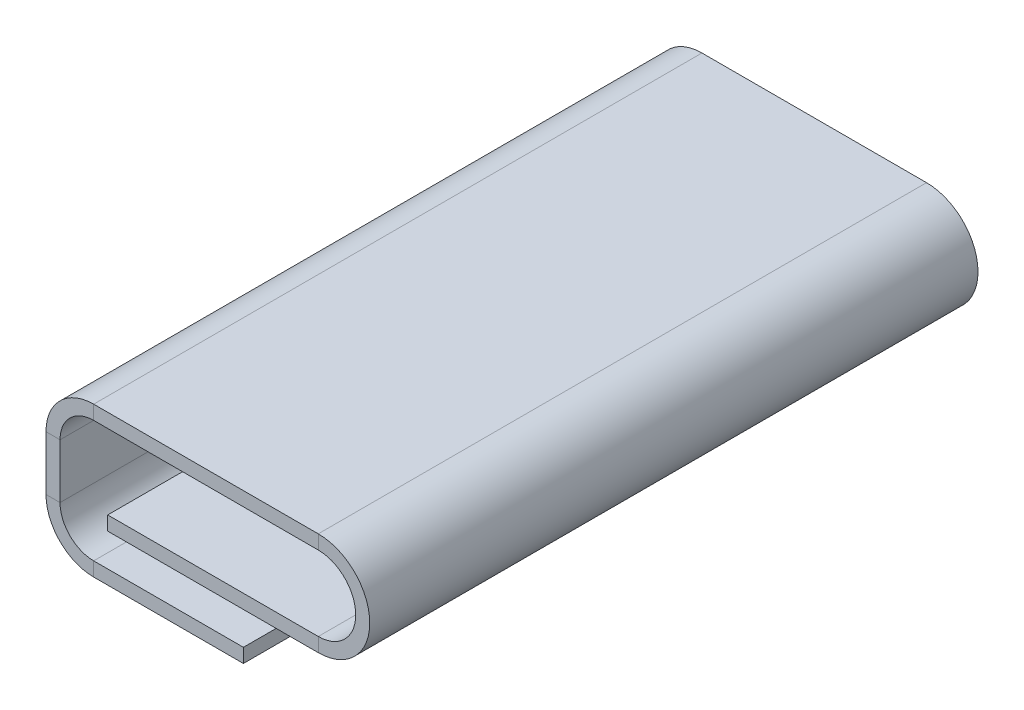
ISO-10303-21;
HEADER;
FILE_DESCRIPTION(('STEP AP214'),'2;1');
FILE_NAME('part.step','',(''),(''),'','','');
FILE_SCHEMA(('AUTOMOTIVE_DESIGN { 1 0 10303 214 1 1 1 1 }'));
ENDSEC;
DATA;
#1=APPLICATION_CONTEXT('core data for automotive mechanical design processes');
#2=APPLICATION_PROTOCOL_DEFINITION('international standard','automotive_design',2000,#1);
#3=PRODUCT_CONTEXT('',#1,'mechanical');
#4=PRODUCT('Part','Part','',(#3));
#5=PRODUCT_RELATED_PRODUCT_CATEGORY('part','',(#4));
#6=PRODUCT_DEFINITION_FORMATION('','',#4);
#7=PRODUCT_DEFINITION_CONTEXT('part definition',#1,'design');
#8=PRODUCT_DEFINITION('design','',#6,#7);
#9=PRODUCT_DEFINITION_SHAPE('','',#8);
#10=(LENGTH_UNIT() NAMED_UNIT(*) SI_UNIT(.MILLI.,.METRE.));
#11=(NAMED_UNIT(*) PLANE_ANGLE_UNIT() SI_UNIT($,.RADIAN.));
#12=(NAMED_UNIT(*) SI_UNIT($,.STERADIAN.) SOLID_ANGLE_UNIT());
#13=UNCERTAINTY_MEASURE_WITH_UNIT(LENGTH_MEASURE(1.E-05),#10,'distance_accuracy_value','');
#14=(GEOMETRIC_REPRESENTATION_CONTEXT(3) GLOBAL_UNCERTAINTY_ASSIGNED_CONTEXT((#13)) GLOBAL_UNIT_ASSIGNED_CONTEXT((#10,
#11,#12)) REPRESENTATION_CONTEXT('',''));
#15=CARTESIAN_POINT('',(0.,0.,0.));
#16=DIRECTION('',(0.,0.,1.));
#17=DIRECTION('',(1.,0.,0.));
#18=AXIS2_PLACEMENT_3D('',#15,#16,#17);
#19=CARTESIAN_POINT('',(3.20000000000001,2.6,6.5));
#20=DIRECTION('',(0.,0.,1.));
#21=DIRECTION('',(1.,0.,0.));
#22=AXIS2_PLACEMENT_3D('',#19,#20,#21);
#23=PLANE('',#22);
#24=DIRECTION('',(0.,1.,0.));
#25=VECTOR('',#24,1.);
#26=CARTESIAN_POINT('',(3.20000000000001,2.6,6.5));
#27=LINE('',#26,#25);
#28=CARTESIAN_POINT('',(3.20000000000001,2.6,6.5));
#29=VERTEX_POINT('',#28);
#30=CARTESIAN_POINT('',(3.20000000000001,2.9,6.5));
#31=VERTEX_POINT('',#30);
#32=EDGE_CURVE('E11',#29,#31,#27,.T.);
#33=ORIENTED_EDGE('',*,*,#32,.F.);
#34=CARTESIAN_POINT('',(3.2,1.8,6.5));
#35=DIRECTION('',(0.,0.,1.));
#36=DIRECTION('',(-1.,0.,0.));
#37=AXIS2_PLACEMENT_3D('',#34,#35,#36);
#38=CIRCLE('',#37,0.8);
#39=CARTESIAN_POINT('',(3.20000000000001,1.,6.5));
#40=VERTEX_POINT('',#39);
#41=EDGE_CURVE('E316',#40,#29,#38,.T.);
#42=ORIENTED_EDGE('',*,*,#41,.F.);
#43=DIRECTION('',(0.,1.,0.));
#44=VECTOR('',#43,1.);
#45=CARTESIAN_POINT('',(3.20000000000001,0.7,6.5));
#46=LINE('',#45,#44);
#47=CARTESIAN_POINT('',(3.20000000000001,0.7,6.5));
#48=VERTEX_POINT('',#47);
#49=EDGE_CURVE('E51',#48,#40,#46,.T.);
#50=ORIENTED_EDGE('',*,*,#49,.F.);
#51=CARTESIAN_POINT('',(3.2,1.8,6.5));
#52=DIRECTION('',(0.,0.,1.));
#53=DIRECTION('',(1.,0.,0.));
#54=AXIS2_PLACEMENT_3D('',#51,#52,#53);
#55=CIRCLE('',#54,1.1);
#56=EDGE_CURVE('E330',#48,#31,#55,.T.);
#57=ORIENTED_EDGE('',*,*,#56,.T.);
#58=EDGE_LOOP('',(#33,#42,#50,#57));
#59=FACE_BOUND('',#58,.T.);
#60=ADVANCED_FACE('F43',(#59),#23,.T.);
#61=CARTESIAN_POINT('',(3.20000000000001,0.7,6.5));
#62=DIRECTION('',(0.,0.,1.));
#63=DIRECTION('',(1.,0.,0.));
#64=AXIS2_PLACEMENT_3D('',#61,#62,#63);
#65=PLANE('',#64);
#66=DIRECTION('',(-1.,0.,0.));
#67=VECTOR('',#66,1.);
#68=CARTESIAN_POINT('',(3.20000000000001,2.6,6.5));
#69=LINE('',#68,#67);
#70=CARTESIAN_POINT('',(-1.59999999999999,2.6,6.5));
#71=VERTEX_POINT('',#70);
#72=EDGE_CURVE('E320',#29,#71,#69,.T.);
#73=ORIENTED_EDGE('',*,*,#72,.F.);
#74=ORIENTED_EDGE('',*,*,#32,.T.);
#75=DIRECTION('',(-1.,0.,0.));
#76=VECTOR('',#75,1.);
#77=CARTESIAN_POINT('',(3.20000000000001,2.9,6.5));
#78=LINE('',#77,#76);
#79=CARTESIAN_POINT('',(-1.59999999999999,2.9,6.5));
#80=VERTEX_POINT('',#79);
#81=EDGE_CURVE('E186',#31,#80,#78,.T.);
#82=ORIENTED_EDGE('',*,*,#81,.T.);
#83=DIRECTION('',(0.,-1.,0.));
#84=VECTOR('',#83,1.);
#85=CARTESIAN_POINT('',(-1.59999999999999,2.9,6.5));
#86=LINE('',#85,#84);
#87=EDGE_CURVE('E177',#80,#71,#86,.T.);
#88=ORIENTED_EDGE('',*,*,#87,.T.);
#89=EDGE_LOOP('',(#73,#74,#82,#88));
#90=FACE_BOUND('',#89,.T.);
#91=ADVANCED_FACE('F335',(#90),#65,.T.);
#92=CARTESIAN_POINT('',(3.20000000000001,1.,-6.5));
#93=DIRECTION('',(0.,0.,-1.));
#94=DIRECTION('',(-1.,0.,0.));
#95=AXIS2_PLACEMENT_3D('',#92,#93,#94);
#96=PLANE('',#95);
#97=DIRECTION('',(0.,-1.,0.));
#98=VECTOR('',#97,1.);
#99=CARTESIAN_POINT('',(3.20000000000001,1.,-6.5));
#100=LINE('',#99,#98);
#101=CARTESIAN_POINT('',(3.20000000000001,1.,-6.5));
#102=VERTEX_POINT('',#101);
#103=CARTESIAN_POINT('',(3.20000000000001,0.7,-6.5));
#104=VERTEX_POINT('',#103);
#105=EDGE_CURVE('E297',#102,#104,#100,.T.);
#106=ORIENTED_EDGE('',*,*,#105,.F.);
#107=CARTESIAN_POINT('',(3.2,1.8,-6.5));
#108=DIRECTION('',(0.,0.,1.));
#109=DIRECTION('',(-1.,0.,0.));
#110=AXIS2_PLACEMENT_3D('',#107,#108,#109);
#111=CIRCLE('',#110,0.8);
#112=CARTESIAN_POINT('',(3.20000000000001,2.6,-6.5));
#113=VERTEX_POINT('',#112);
#114=EDGE_CURVE('E226',#102,#113,#111,.T.);
#115=ORIENTED_EDGE('',*,*,#114,.T.);
#116=DIRECTION('',(0.,-1.,0.));
#117=VECTOR('',#116,1.);
#118=CARTESIAN_POINT('',(3.20000000000001,2.9,-6.5));
#119=LINE('',#118,#117);
#120=CARTESIAN_POINT('',(3.20000000000001,2.9,-6.5));
#121=VERTEX_POINT('',#120);
#122=EDGE_CURVE('E176',#121,#113,#119,.T.);
#123=ORIENTED_EDGE('',*,*,#122,.F.);
#124=CARTESIAN_POINT('',(3.2,1.8,-6.5));
#125=DIRECTION('',(0.,0.,1.));
#126=DIRECTION('',(1.,0.,0.));
#127=AXIS2_PLACEMENT_3D('',#124,#125,#126);
#128=CIRCLE('',#127,1.1);
#129=EDGE_CURVE('E238',#104,#121,#128,.T.);
#130=ORIENTED_EDGE('',*,*,#129,.F.);
#131=EDGE_LOOP('',(#106,#115,#123,#130));
#132=FACE_BOUND('',#131,.T.);
#133=ADVANCED_FACE('F387',(#132),#96,.T.);
#134=CARTESIAN_POINT('',(3.20000000000001,2.9,-6.5));
#135=DIRECTION('',(0.,0.,-1.));
#136=DIRECTION('',(-1.,0.,0.));
#137=AXIS2_PLACEMENT_3D('',#134,#135,#136);
#138=PLANE('',#137);
#139=DIRECTION('',(1.,0.,0.));
#140=VECTOR('',#139,1.);
#141=CARTESIAN_POINT('',(-1.3,1.,-6.5));
#142=LINE('',#141,#140);
#143=CARTESIAN_POINT('',(-1.3,1.,-6.5));
#144=VERTEX_POINT('',#143);
#145=EDGE_CURVE('E229',#144,#102,#142,.T.);
#146=ORIENTED_EDGE('',*,*,#145,.T.);
#147=ORIENTED_EDGE('',*,*,#105,.T.);
#148=DIRECTION('',(1.,0.,0.));
#149=VECTOR('',#148,1.);
#150=CARTESIAN_POINT('',(1.6,0.7,-6.5));
#151=LINE('',#150,#149);
#152=CARTESIAN_POINT('',(-1.3,0.7,-6.5));
#153=VERTEX_POINT('',#152);
#154=EDGE_CURVE('E235',#153,#104,#151,.T.);
#155=ORIENTED_EDGE('',*,*,#154,.F.);
#156=DIRECTION('',(0.,1.,0.));
#157=VECTOR('',#156,1.);
#158=CARTESIAN_POINT('',(-1.3,0.7,-6.5));
#159=LINE('',#158,#157);
#160=EDGE_CURVE('E232',#153,#144,#159,.T.);
#161=ORIENTED_EDGE('',*,*,#160,.T.);
#162=EDGE_LOOP('',(#146,#147,#155,#161));
#163=FACE_BOUND('',#162,.T.);
#164=ADVANCED_FACE('F390',(#163),#138,.T.);
#165=CARTESIAN_POINT('',(-2.31891077438566,1.88108922561433,6.5));
#166=DIRECTION('',(0.,0.,1.));
#167=DIRECTION('',(1.,0.,0.));
#168=AXIS2_PLACEMENT_3D('',#165,#166,#167);
#169=PLANE('',#168);
#170=DIRECTION('',(-1.,0.,0.));
#171=VECTOR('',#170,1.);
#172=CARTESIAN_POINT('',(-2.31891077438566,1.88108922561433,6.5));
#173=LINE('',#172,#171);
#174=CARTESIAN_POINT('',(-2.31891077438566,1.88108922561433,6.5));
#175=VERTEX_POINT('',#174);
#176=CARTESIAN_POINT('',(-2.61891077438566,1.88108922561433,6.5));
#177=VERTEX_POINT('',#176);
#178=EDGE_CURVE('E164',#175,#177,#173,.T.);
#179=ORIENTED_EDGE('',*,*,#178,.F.);
#180=CARTESIAN_POINT('',(-1.59999999999999,1.88108922561433,6.5));
#181=DIRECTION('',(0.,0.,1.));
#182=DIRECTION('',(1.,0.,0.));
#183=AXIS2_PLACEMENT_3D('',#180,#181,#182);
#184=CIRCLE('',#183,0.718910774385668);
#185=EDGE_CURVE('E347',#71,#175,#184,.T.);
#186=ORIENTED_EDGE('',*,*,#185,.F.);
#187=ORIENTED_EDGE('',*,*,#87,.F.);
#188=CARTESIAN_POINT('',(-1.59999999999999,1.88108922561433,6.5));
#189=DIRECTION('',(0.,0.,1.));
#190=DIRECTION('',(1.,0.,0.));
#191=AXIS2_PLACEMENT_3D('',#188,#189,#190);
#192=CIRCLE('',#191,1.01891077438567);
#193=EDGE_CURVE('E180',#80,#177,#192,.T.);
#194=ORIENTED_EDGE('',*,*,#193,.T.);
#195=EDGE_LOOP('',(#179,#186,#187,#194));
#196=FACE_BOUND('',#195,.T.);
#197=ADVANCED_FACE('F182',(#196),#169,.T.);
#198=CARTESIAN_POINT('',(-1.59999999999999,2.9,6.5));
#199=DIRECTION('',(0.,0.,1.));
#200=DIRECTION('',(1.,0.,0.));
#201=AXIS2_PLACEMENT_3D('',#198,#199,#200);
#202=PLANE('',#201);
#203=DIRECTION('',(0.,-1.,0.));
#204=VECTOR('',#203,1.);
#205=CARTESIAN_POINT('',(-2.31891077438566,1.88108922561433,6.5));
#206=LINE('',#205,#204);
#207=CARTESIAN_POINT('',(-2.31891077438566,0.718910774385668,6.5));
#208=VERTEX_POINT('',#207);
#209=EDGE_CURVE('E171',#175,#208,#206,.T.);
#210=ORIENTED_EDGE('',*,*,#209,.F.);
#211=ORIENTED_EDGE('',*,*,#178,.T.);
#212=DIRECTION('',(0.,-1.,0.));
#213=VECTOR('',#212,1.);
#214=CARTESIAN_POINT('',(-2.61891077438566,1.88108922561433,6.5));
#215=LINE('',#214,#213);
#216=CARTESIAN_POINT('',(-2.61891077438566,0.718910774385669,6.5));
#217=VERTEX_POINT('',#216);
#218=EDGE_CURVE('E168',#177,#217,#215,.T.);
#219=ORIENTED_EDGE('',*,*,#218,.T.);
#220=DIRECTION('',(1.,0.,0.));
#221=VECTOR('',#220,1.);
#222=CARTESIAN_POINT('',(-2.61891077438566,0.718910774385669,6.5));
#223=LINE('',#222,#221);
#224=EDGE_CURVE('E288',#217,#208,#223,.T.);
#225=ORIENTED_EDGE('',*,*,#224,.T.);
#226=EDGE_LOOP('',(#210,#211,#219,#225));
#227=FACE_BOUND('',#226,.T.);
#228=ADVANCED_FACE('F166',(#227),#202,.T.);
#229=CARTESIAN_POINT('',(-1.59999999999999,2.6,-6.5));
#230=DIRECTION('',(0.,0.,-1.));
#231=DIRECTION('',(-1.,0.,0.));
#232=AXIS2_PLACEMENT_3D('',#229,#230,#231);
#233=PLANE('',#232);
#234=DIRECTION('',(0.,1.,0.));
#235=VECTOR('',#234,1.);
#236=CARTESIAN_POINT('',(-1.59999999999999,2.6,-6.5));
#237=LINE('',#236,#235);
#238=CARTESIAN_POINT('',(-1.59999999999999,2.6,-6.5));
#239=VERTEX_POINT('',#238);
#240=CARTESIAN_POINT('',(-1.59999999999999,2.9,-6.5));
#241=VERTEX_POINT('',#240);
#242=EDGE_CURVE('E293',#239,#241,#237,.T.);
#243=ORIENTED_EDGE('',*,*,#242,.F.);
#244=CARTESIAN_POINT('',(-1.59999999999999,1.88108922561433,-6.5));
#245=DIRECTION('',(0.,0.,1.));
#246=DIRECTION('',(1.,0.,0.));
#247=AXIS2_PLACEMENT_3D('',#244,#245,#246);
#248=CIRCLE('',#247,0.718910774385668);
#249=CARTESIAN_POINT('',(-2.31891077438566,1.88108922561433,-6.5));
#250=VERTEX_POINT('',#249);
#251=EDGE_CURVE('E220',#239,#250,#248,.T.);
#252=ORIENTED_EDGE('',*,*,#251,.T.);
#253=DIRECTION('',(1.,0.,0.));
#254=VECTOR('',#253,1.);
#255=CARTESIAN_POINT('',(-2.61891077438566,1.88108922561433,-6.5));
#256=LINE('',#255,#254);
#257=CARTESIAN_POINT('',(-2.61891077438566,1.88108922561433,-6.5));
#258=VERTEX_POINT('',#257);
#259=EDGE_CURVE('E291',#258,#250,#256,.T.);
#260=ORIENTED_EDGE('',*,*,#259,.F.);
#261=CARTESIAN_POINT('',(-1.59999999999999,1.88108922561433,-6.5));
#262=DIRECTION('',(0.,0.,1.));
#263=DIRECTION('',(1.,0.,0.));
#264=AXIS2_PLACEMENT_3D('',#261,#262,#263);
#265=CIRCLE('',#264,1.01891077438567);
#266=EDGE_CURVE('E193',#241,#258,#265,.T.);
#267=ORIENTED_EDGE('',*,*,#266,.F.);
#268=EDGE_LOOP('',(#243,#252,#260,#267));
#269=FACE_BOUND('',#268,.T.);
#270=ADVANCED_FACE('F341',(#269),#233,.T.);
#271=CARTESIAN_POINT('',(-2.61891077438566,1.88108922561433,-6.5));
#272=DIRECTION('',(0.,0.,-1.));
#273=DIRECTION('',(-1.,0.,0.));
#274=AXIS2_PLACEMENT_3D('',#271,#272,#273);
#275=PLANE('',#274);
#276=DIRECTION('',(-1.,0.,0.));
#277=VECTOR('',#276,1.);
#278=CARTESIAN_POINT('',(3.20000000000001,2.6,-6.5));
#279=LINE('',#278,#277);
#280=EDGE_CURVE('E223',#113,#239,#279,.T.);
#281=ORIENTED_EDGE('',*,*,#280,.T.);
#282=ORIENTED_EDGE('',*,*,#242,.T.);
#283=DIRECTION('',(-1.,0.,0.));
#284=VECTOR('',#283,1.);
#285=CARTESIAN_POINT('',(3.20000000000001,2.9,-6.5));
#286=LINE('',#285,#284);
#287=EDGE_CURVE('E241',#121,#241,#286,.T.);
#288=ORIENTED_EDGE('',*,*,#287,.F.);
#289=ORIENTED_EDGE('',*,*,#122,.T.);
#290=EDGE_LOOP('',(#281,#282,#288,#289));
#291=FACE_BOUND('',#290,.T.);
#292=ADVANCED_FACE('F400',(#291),#275,.T.);
#293=CARTESIAN_POINT('',(-1.6,0.,6.5));
#294=DIRECTION('',(0.,0.,1.));
#295=DIRECTION('',(1.,0.,0.));
#296=AXIS2_PLACEMENT_3D('',#293,#294,#295);
#297=PLANE('',#296);
#298=DIRECTION('',(0.,-1.,0.));
#299=VECTOR('',#298,1.);
#300=CARTESIAN_POINT('',(-1.6,0.,6.5));
#301=LINE('',#300,#299);
#302=CARTESIAN_POINT('',(-1.6,0.,6.5));
#303=VERTEX_POINT('',#302);
#304=CARTESIAN_POINT('',(-1.6,-0.3,6.5));
#305=VERTEX_POINT('',#304);
#306=EDGE_CURVE('E59',#303,#305,#301,.T.);
#307=ORIENTED_EDGE('',*,*,#306,.F.);
#308=CARTESIAN_POINT('',(-1.59999999999999,0.718910774385668,6.5));
#309=DIRECTION('',(0.,0.,1.));
#310=DIRECTION('',(-1.,0.,0.));
#311=AXIS2_PLACEMENT_3D('',#308,#309,#310);
#312=CIRCLE('',#311,0.718910774385669);
#313=EDGE_CURVE('E375',#208,#303,#312,.T.);
#314=ORIENTED_EDGE('',*,*,#313,.F.);
#315=ORIENTED_EDGE('',*,*,#224,.F.);
#316=CARTESIAN_POINT('',(-1.59999999999999,0.718910774385668,6.5));
#317=DIRECTION('',(0.,0.,1.));
#318=DIRECTION('',(1.,0.,0.));
#319=AXIS2_PLACEMENT_3D('',#316,#317,#318);
#320=CIRCLE('',#319,1.01891077438567);
#321=EDGE_CURVE('E201',#217,#305,#320,.T.);
#322=ORIENTED_EDGE('',*,*,#321,.T.);
#323=EDGE_LOOP('',(#307,#314,#315,#322));
#324=FACE_BOUND('',#323,.T.);
#325=ADVANCED_FACE('F402',(#324),#297,.T.);
#326=CARTESIAN_POINT('',(-2.61891077438566,0.718910774385669,6.5));
#327=DIRECTION('',(0.,0.,1.));
#328=DIRECTION('',(1.,0.,0.));
#329=AXIS2_PLACEMENT_3D('',#326,#327,#328);
#330=PLANE('',#329);
#331=DIRECTION('',(1.,0.,0.));
#332=VECTOR('',#331,1.);
#333=CARTESIAN_POINT('',(-1.6,0.,6.5));
#334=LINE('',#333,#332);
#335=CARTESIAN_POINT('',(1.6,0.,6.5));
#336=VERTEX_POINT('',#335);
#337=EDGE_CURVE('E373',#303,#336,#334,.T.);
#338=ORIENTED_EDGE('',*,*,#337,.F.);
#339=ORIENTED_EDGE('',*,*,#306,.T.);
#340=DIRECTION('',(1.,0.,0.));
#341=VECTOR('',#340,1.);
#342=CARTESIAN_POINT('',(-1.6,-0.3,6.5));
#343=LINE('',#342,#341);
#344=CARTESIAN_POINT('',(1.6,-0.3,6.5));
#345=VERTEX_POINT('',#344);
#346=EDGE_CURVE('E125',#305,#345,#343,.T.);
#347=ORIENTED_EDGE('',*,*,#346,.T.);
#348=DIRECTION('',(0.,-1.,0.));
#349=VECTOR('',#348,1.);
#350=CARTESIAN_POINT('',(1.6,0.,6.5));
#351=LINE('',#350,#349);
#352=EDGE_CURVE('E371',#336,#345,#351,.T.);
#353=ORIENTED_EDGE('',*,*,#352,.F.);
#354=EDGE_LOOP('',(#338,#339,#347,#353));
#355=FACE_BOUND('',#354,.T.);
#356=ADVANCED_FACE('F408',(#355),#330,.T.);
#357=CARTESIAN_POINT('',(-2.31891077438566,0.718910774385668,-6.5));
#358=DIRECTION('',(0.,0.,-1.));
#359=DIRECTION('',(-1.,0.,0.));
#360=AXIS2_PLACEMENT_3D('',#357,#358,#359);
#361=PLANE('',#360);
#362=DIRECTION('',(-1.,0.,0.));
#363=VECTOR('',#362,1.);
#364=CARTESIAN_POINT('',(-2.31891077438566,0.718910774385668,-6.5));
#365=LINE('',#364,#363);
#366=CARTESIAN_POINT('',(-2.31891077438566,0.718910774385668,-6.5));
#367=VERTEX_POINT('',#366);
#368=CARTESIAN_POINT('',(-2.61891077438566,0.718910774385669,-6.5));
#369=VERTEX_POINT('',#368);
#370=EDGE_CURVE('E112',#367,#369,#365,.T.);
#371=ORIENTED_EDGE('',*,*,#370,.F.);
#372=CARTESIAN_POINT('',(-1.59999999999999,0.718910774385668,-6.5));
#373=DIRECTION('',(0.,0.,1.));
#374=DIRECTION('',(-1.,0.,0.));
#375=AXIS2_PLACEMENT_3D('',#372,#373,#374);
#376=CIRCLE('',#375,0.718910774385669);
#377=CARTESIAN_POINT('',(-1.6,0.,-6.5));
#378=VERTEX_POINT('',#377);
#379=EDGE_CURVE('E216',#367,#378,#376,.T.);
#380=ORIENTED_EDGE('',*,*,#379,.T.);
#381=DIRECTION('',(0.,1.,0.));
#382=VECTOR('',#381,1.);
#383=CARTESIAN_POINT('',(-1.6,-0.3,-6.5));
#384=LINE('',#383,#382);
#385=CARTESIAN_POINT('',(-1.6,-0.3,-6.5));
#386=VERTEX_POINT('',#385);
#387=EDGE_CURVE('E119',#386,#378,#384,.T.);
#388=ORIENTED_EDGE('',*,*,#387,.F.);
#389=CARTESIAN_POINT('',(-1.59999999999999,0.718910774385668,-6.5));
#390=DIRECTION('',(0.,0.,1.));
#391=DIRECTION('',(1.,0.,0.));
#392=AXIS2_PLACEMENT_3D('',#389,#390,#391);
#393=CIRCLE('',#392,1.01891077438567);
#394=EDGE_CURVE('E247',#369,#386,#393,.T.);
#395=ORIENTED_EDGE('',*,*,#394,.F.);
#396=EDGE_LOOP('',(#371,#380,#388,#395));
#397=FACE_BOUND('',#396,.T.);
#398=ADVANCED_FACE('F358',(#397),#361,.T.);
#399=CARTESIAN_POINT('',(-1.6,-0.3,-6.5));
#400=DIRECTION('',(0.,0.,-1.));
#401=DIRECTION('',(-1.,0.,0.));
#402=AXIS2_PLACEMENT_3D('',#399,#400,#401);
#403=PLANE('',#402);
#404=DIRECTION('',(0.,-1.,0.));
#405=VECTOR('',#404,1.);
#406=CARTESIAN_POINT('',(-2.31891077438566,1.88108922561433,-6.5));
#407=LINE('',#406,#405);
#408=EDGE_CURVE('E218',#250,#367,#407,.T.);
#409=ORIENTED_EDGE('',*,*,#408,.T.);
#410=ORIENTED_EDGE('',*,*,#370,.T.);
#411=DIRECTION('',(0.,-1.,0.));
#412=VECTOR('',#411,1.);
#413=CARTESIAN_POINT('',(-2.61891077438566,1.88108922561433,-6.5));
#414=LINE('',#413,#412);
#415=EDGE_CURVE('E245',#258,#369,#414,.T.);
#416=ORIENTED_EDGE('',*,*,#415,.F.);
#417=ORIENTED_EDGE('',*,*,#259,.T.);
#418=EDGE_LOOP('',(#409,#410,#416,#417));
#419=FACE_BOUND('',#418,.T.);
#420=ADVANCED_FACE('F343',(#419),#403,.T.);
#421=CARTESIAN_POINT('',(-1.6,-0.3,6.5));
#422=DIRECTION('',(0.,1.,0.));
#423=DIRECTION('',(0.,0.,1.));
#424=AXIS2_PLACEMENT_3D('',#421,#422,#423);
#425=PLANE('',#424);
#426=DIRECTION('',(1.,0.,0.));
#427=VECTOR('',#426,1.);
#428=CARTESIAN_POINT('',(-1.6,-0.3,-6.5));
#429=LINE('',#428,#427);
#430=CARTESIAN_POINT('',(1.6,-0.3,-6.5));
#431=VERTEX_POINT('',#430);
#432=EDGE_CURVE('E207',#386,#431,#429,.T.);
#433=ORIENTED_EDGE('',*,*,#432,.T.);
#434=DIRECTION('',(0.,0.,-1.));
#435=VECTOR('',#434,1.);
#436=CARTESIAN_POINT('',(1.6,-0.3,6.5));
#437=LINE('',#436,#435);
#438=EDGE_CURVE('E284',#345,#431,#437,.T.);
#439=ORIENTED_EDGE('',*,*,#438,.F.);
#440=ORIENTED_EDGE('',*,*,#346,.F.);
#441=DIRECTION('',(0.,0.,-1.));
#442=VECTOR('',#441,1.);
#443=CARTESIAN_POINT('',(-1.6,-0.3,6.5));
#444=LINE('',#443,#442);
#445=EDGE_CURVE('E203',#305,#386,#444,.T.);
#446=ORIENTED_EDGE('',*,*,#445,.T.);
#447=EDGE_LOOP('',(#433,#439,#440,#446));
#448=FACE_BOUND('',#447,.T.);
#449=ADVANCED_FACE('F364',(#448),#425,.F.);
#450=CARTESIAN_POINT('',(1.6,0.,6.5));
#451=DIRECTION('',(1.,0.,0.));
#452=DIRECTION('',(0.,0.,-1.));
#453=AXIS2_PLACEMENT_3D('',#450,#451,#452);
#454=PLANE('',#453);
#455=DIRECTION('',(0.,-1.,0.));
#456=VECTOR('',#455,1.);
#457=CARTESIAN_POINT('',(1.6,0.,-6.5));
#458=LINE('',#457,#456);
#459=CARTESIAN_POINT('',(1.6,0.,-6.5));
#460=VERTEX_POINT('',#459);
#461=EDGE_CURVE('E210',#460,#431,#458,.T.);
#462=ORIENTED_EDGE('',*,*,#461,.F.);
#463=DIRECTION('',(0.,0.,-1.));
#464=VECTOR('',#463,1.);
#465=CARTESIAN_POINT('',(1.6,0.,6.5));
#466=LINE('',#465,#464);
#467=EDGE_CURVE('E282',#336,#460,#466,.T.);
#468=ORIENTED_EDGE('',*,*,#467,.F.);
#469=ORIENTED_EDGE('',*,*,#352,.T.);
#470=ORIENTED_EDGE('',*,*,#438,.T.);
#471=EDGE_LOOP('',(#462,#468,#469,#470));
#472=FACE_BOUND('',#471,.T.);
#473=ADVANCED_FACE('F369',(#472),#454,.T.);
#474=CARTESIAN_POINT('',(-1.6,0.,6.5));
#475=DIRECTION('',(0.,1.,0.));
#476=DIRECTION('',(0.,0.,1.));
#477=AXIS2_PLACEMENT_3D('',#474,#475,#476);
#478=PLANE('',#477);
#479=DIRECTION('',(1.,0.,0.));
#480=VECTOR('',#479,1.);
#481=CARTESIAN_POINT('',(-1.6,0.,-6.5));
#482=LINE('',#481,#480);
#483=EDGE_CURVE('E213',#378,#460,#482,.T.);
#484=ORIENTED_EDGE('',*,*,#483,.F.);
#485=DIRECTION('',(0.,0.,-1.));
#486=VECTOR('',#485,1.);
#487=CARTESIAN_POINT('',(-1.6,0.,6.5));
#488=LINE('',#487,#486);
#489=EDGE_CURVE('E279',#303,#378,#488,.T.);
#490=ORIENTED_EDGE('',*,*,#489,.F.);
#491=ORIENTED_EDGE('',*,*,#337,.T.);
#492=ORIENTED_EDGE('',*,*,#467,.T.);
#493=EDGE_LOOP('',(#484,#490,#491,#492));
#494=FACE_BOUND('',#493,.T.);
#495=ADVANCED_FACE('F492',(#494),#478,.T.);
#496=CARTESIAN_POINT('',(-1.59999999999999,0.718910774385668,6.5));
#497=DIRECTION('',(0.,0.,-1.));
#498=DIRECTION('',(-1.,0.,0.));
#499=AXIS2_PLACEMENT_3D('',#496,#497,#498);
#500=CYLINDRICAL_SURFACE('',#499,0.718910774385669);
#501=ORIENTED_EDGE('',*,*,#379,.F.);
#502=DIRECTION('',(0.,0.,-1.));
#503=VECTOR('',#502,1.);
#504=CARTESIAN_POINT('',(-2.31891077438566,0.718910774385668,6.5));
#505=LINE('',#504,#503);
#506=EDGE_CURVE('E276',#208,#367,#505,.T.);
#507=ORIENTED_EDGE('',*,*,#506,.F.);
#508=ORIENTED_EDGE('',*,*,#313,.T.);
#509=ORIENTED_EDGE('',*,*,#489,.T.);
#510=EDGE_LOOP('',(#501,#507,#508,#509));
#511=FACE_BOUND('',#510,.T.);
#512=ADVANCED_FACE('F355',(#511),#500,.F.);
#513=CARTESIAN_POINT('',(-2.31891077438566,1.88108922561433,6.5));
#514=DIRECTION('',(1.,0.,0.));
#515=DIRECTION('',(0.,1.,0.));
#516=AXIS2_PLACEMENT_3D('',#513,#514,#515);
#517=PLANE('',#516);
#518=ORIENTED_EDGE('',*,*,#408,.F.);
#519=DIRECTION('',(0.,0.,-1.));
#520=VECTOR('',#519,1.);
#521=CARTESIAN_POINT('',(-2.31891077438566,1.88108922561433,6.5));
#522=LINE('',#521,#520);
#523=EDGE_CURVE('E273',#175,#250,#522,.T.);
#524=ORIENTED_EDGE('',*,*,#523,.F.);
#525=ORIENTED_EDGE('',*,*,#209,.T.);
#526=ORIENTED_EDGE('',*,*,#506,.T.);
#527=EDGE_LOOP('',(#518,#524,#525,#526));
#528=FACE_BOUND('',#527,.T.);
#529=ADVANCED_FACE('F349',(#528),#517,.T.);
#530=CARTESIAN_POINT('',(-1.59999999999999,1.88108922561433,6.5));
#531=DIRECTION('',(0.,0.,-1.));
#532=DIRECTION('',(-1.,0.,0.));
#533=AXIS2_PLACEMENT_3D('',#530,#531,#532);
#534=CYLINDRICAL_SURFACE('',#533,0.718910774385668);
#535=ORIENTED_EDGE('',*,*,#251,.F.);
#536=DIRECTION('',(0.,0.,-1.));
#537=VECTOR('',#536,1.);
#538=CARTESIAN_POINT('',(-1.59999999999999,2.6,6.5));
#539=LINE('',#538,#537);
#540=EDGE_CURVE('E270',#71,#239,#539,.T.);
#541=ORIENTED_EDGE('',*,*,#540,.F.);
#542=ORIENTED_EDGE('',*,*,#185,.T.);
#543=ORIENTED_EDGE('',*,*,#523,.T.);
#544=EDGE_LOOP('',(#535,#541,#542,#543));
#545=FACE_BOUND('',#544,.T.);
#546=ADVANCED_FACE('F346',(#545),#534,.F.);
#547=CARTESIAN_POINT('',(3.20000000000001,2.6,6.5));
#548=DIRECTION('',(0.,-1.,0.));
#549=DIRECTION('',(1.,0.,0.));
#550=AXIS2_PLACEMENT_3D('',#547,#548,#549);
#551=PLANE('',#550);
#552=ORIENTED_EDGE('',*,*,#280,.F.);
#553=DIRECTION('',(0.,0.,-1.));
#554=VECTOR('',#553,1.);
#555=CARTESIAN_POINT('',(3.20000000000001,2.6,6.5));
#556=LINE('',#555,#554);
#557=EDGE_CURVE('E267',#29,#113,#556,.T.);
#558=ORIENTED_EDGE('',*,*,#557,.F.);
#559=ORIENTED_EDGE('',*,*,#72,.T.);
#560=ORIENTED_EDGE('',*,*,#540,.T.);
#561=EDGE_LOOP('',(#552,#558,#559,#560));
#562=FACE_BOUND('',#561,.T.);
#563=ADVANCED_FACE('F384',(#562),#551,.T.);
#564=CARTESIAN_POINT('',(3.2,1.8,6.5));
#565=DIRECTION('',(0.,0.,-1.));
#566=DIRECTION('',(-1.,0.,0.));
#567=AXIS2_PLACEMENT_3D('',#564,#565,#566);
#568=CYLINDRICAL_SURFACE('',#567,0.8);
#569=ORIENTED_EDGE('',*,*,#114,.F.);
#570=DIRECTION('',(0.,0.,-1.));
#571=VECTOR('',#570,1.);
#572=CARTESIAN_POINT('',(3.20000000000001,1.,6.5));
#573=LINE('',#572,#571);
#574=EDGE_CURVE('E264',#40,#102,#573,.T.);
#575=ORIENTED_EDGE('',*,*,#574,.F.);
#576=ORIENTED_EDGE('',*,*,#41,.T.);
#577=ORIENTED_EDGE('',*,*,#557,.T.);
#578=EDGE_LOOP('',(#569,#575,#576,#577));
#579=FACE_BOUND('',#578,.T.);
#580=ADVANCED_FACE('F315',(#579),#568,.F.);
#581=CARTESIAN_POINT('',(-1.3,1.,6.5));
#582=DIRECTION('',(0.,1.,0.));
#583=DIRECTION('',(0.,0.,1.));
#584=AXIS2_PLACEMENT_3D('',#581,#582,#583);
#585=PLANE('',#584);
#586=ORIENTED_EDGE('',*,*,#145,.F.);
#587=DIRECTION('',(0.,0.,-1.));
#588=VECTOR('',#587,1.);
#589=CARTESIAN_POINT('',(-1.3,1.,6.5));
#590=LINE('',#589,#588);
#591=CARTESIAN_POINT('',(-1.3,1.,6.5));
#592=VERTEX_POINT('',#591);
#593=EDGE_CURVE('E262',#592,#144,#590,.T.);
#594=ORIENTED_EDGE('',*,*,#593,.F.);
#595=DIRECTION('',(1.,0.,0.));
#596=VECTOR('',#595,1.);
#597=CARTESIAN_POINT('',(1.6,1.,6.5));
#598=LINE('',#597,#596);
#599=EDGE_CURVE('E304',#592,#40,#598,.T.);
#600=ORIENTED_EDGE('',*,*,#599,.T.);
#601=ORIENTED_EDGE('',*,*,#574,.T.);
#602=EDGE_LOOP('',(#586,#594,#600,#601));
#603=FACE_BOUND('',#602,.T.);
#604=ADVANCED_FACE('F322',(#603),#585,.T.);
#605=CARTESIAN_POINT('',(-1.3,0.7,6.5));
#606=DIRECTION('',(-1.,0.,0.));
#607=DIRECTION('',(0.,0.,1.));
#608=AXIS2_PLACEMENT_3D('',#605,#606,#607);
#609=PLANE('',#608);
#610=ORIENTED_EDGE('',*,*,#160,.F.);
#611=DIRECTION('',(0.,0.,-1.));
#612=VECTOR('',#611,1.);
#613=CARTESIAN_POINT('',(-1.3,0.7,6.5));
#614=LINE('',#613,#612);
#615=CARTESIAN_POINT('',(-1.3,0.7,6.5));
#616=VERTEX_POINT('',#615);
#617=EDGE_CURVE('E259',#616,#153,#614,.T.);
#618=ORIENTED_EDGE('',*,*,#617,.F.);
#619=DIRECTION('',(0.,1.,0.));
#620=VECTOR('',#619,1.);
#621=CARTESIAN_POINT('',(-1.3,0.7,6.5));
#622=LINE('',#621,#620);
#623=EDGE_CURVE('E324',#616,#592,#622,.T.);
#624=ORIENTED_EDGE('',*,*,#623,.T.);
#625=ORIENTED_EDGE('',*,*,#593,.T.);
#626=EDGE_LOOP('',(#610,#618,#624,#625));
#627=FACE_BOUND('',#626,.T.);
#628=ADVANCED_FACE('F393',(#627),#609,.T.);
#629=CARTESIAN_POINT('',(1.6,0.7,6.5));
#630=DIRECTION('',(0.,1.,0.));
#631=DIRECTION('',(0.,0.,1.));
#632=AXIS2_PLACEMENT_3D('',#629,#630,#631);
#633=PLANE('',#632);
#634=ORIENTED_EDGE('',*,*,#154,.T.);
#635=DIRECTION('',(0.,0.,-1.));
#636=VECTOR('',#635,1.);
#637=CARTESIAN_POINT('',(3.20000000000001,0.7,6.5));
#638=LINE('',#637,#636);
#639=EDGE_CURVE('E256',#48,#104,#638,.T.);
#640=ORIENTED_EDGE('',*,*,#639,.F.);
#641=DIRECTION('',(1.,0.,0.));
#642=VECTOR('',#641,1.);
#643=CARTESIAN_POINT('',(-1.3,0.7,6.5));
#644=LINE('',#643,#642);
#645=EDGE_CURVE('E307',#616,#48,#644,.T.);
#646=ORIENTED_EDGE('',*,*,#645,.F.);
#647=ORIENTED_EDGE('',*,*,#617,.T.);
#648=EDGE_LOOP('',(#634,#640,#646,#647));
#649=FACE_BOUND('',#648,.T.);
#650=ADVANCED_FACE('F395',(#649),#633,.F.);
#651=CARTESIAN_POINT('',(3.2,1.8,6.5));
#652=DIRECTION('',(0.,0.,-1.));
#653=DIRECTION('',(-1.,0.,0.));
#654=AXIS2_PLACEMENT_3D('',#651,#652,#653);
#655=CYLINDRICAL_SURFACE('',#654,1.1);
#656=ORIENTED_EDGE('',*,*,#129,.T.);
#657=DIRECTION('',(0.,0.,-1.));
#658=VECTOR('',#657,1.);
#659=CARTESIAN_POINT('',(3.20000000000001,2.9,6.5));
#660=LINE('',#659,#658);
#661=EDGE_CURVE('E253',#31,#121,#660,.T.);
#662=ORIENTED_EDGE('',*,*,#661,.F.);
#663=ORIENTED_EDGE('',*,*,#56,.F.);
#664=ORIENTED_EDGE('',*,*,#639,.T.);
#665=EDGE_LOOP('',(#656,#662,#663,#664));
#666=FACE_BOUND('',#665,.T.);
#667=ADVANCED_FACE('F399',(#666),#655,.T.);
#668=CARTESIAN_POINT('',(3.20000000000001,2.9,6.5));
#669=DIRECTION('',(0.,-1.,0.));
#670=DIRECTION('',(1.,0.,0.));
#671=AXIS2_PLACEMENT_3D('',#668,#669,#670);
#672=PLANE('',#671);
#673=ORIENTED_EDGE('',*,*,#287,.T.);
#674=DIRECTION('',(0.,0.,-1.));
#675=VECTOR('',#674,1.);
#676=CARTESIAN_POINT('',(-1.59999999999999,2.9,6.5));
#677=LINE('',#676,#675);
#678=EDGE_CURVE('E195',#80,#241,#677,.T.);
#679=ORIENTED_EDGE('',*,*,#678,.F.);
#680=ORIENTED_EDGE('',*,*,#81,.F.);
#681=ORIENTED_EDGE('',*,*,#661,.T.);
#682=EDGE_LOOP('',(#673,#679,#680,#681));
#683=FACE_BOUND('',#682,.T.);
#684=ADVANCED_FACE('F338',(#683),#672,.F.);
#685=CARTESIAN_POINT('',(-1.59999999999999,1.88108922561433,6.5));
#686=DIRECTION('',(0.,0.,-1.));
#687=DIRECTION('',(-1.,0.,0.));
#688=AXIS2_PLACEMENT_3D('',#685,#686,#687);
#689=CYLINDRICAL_SURFACE('',#688,1.01891077438567);
#690=ORIENTED_EDGE('',*,*,#266,.T.);
#691=DIRECTION('',(0.,0.,-1.));
#692=VECTOR('',#691,1.);
#693=CARTESIAN_POINT('',(-2.61891077438566,1.88108922561433,6.5));
#694=LINE('',#693,#692);
#695=EDGE_CURVE('E190',#177,#258,#694,.T.);
#696=ORIENTED_EDGE('',*,*,#695,.F.);
#697=ORIENTED_EDGE('',*,*,#193,.F.);
#698=ORIENTED_EDGE('',*,*,#678,.T.);
#699=EDGE_LOOP('',(#690,#696,#697,#698));
#700=FACE_BOUND('',#699,.T.);
#701=ADVANCED_FACE('F191',(#700),#689,.T.);
#702=CARTESIAN_POINT('',(-2.61891077438566,1.88108922561433,6.5));
#703=DIRECTION('',(1.,0.,0.));
#704=DIRECTION('',(0.,1.,0.));
#705=AXIS2_PLACEMENT_3D('',#702,#703,#704);
#706=PLANE('',#705);
#707=ORIENTED_EDGE('',*,*,#415,.T.);
#708=DIRECTION('',(0.,0.,-1.));
#709=VECTOR('',#708,1.);
#710=CARTESIAN_POINT('',(-2.61891077438566,0.718910774385669,6.5));
#711=LINE('',#710,#709);
#712=EDGE_CURVE('E196',#217,#369,#711,.T.);
#713=ORIENTED_EDGE('',*,*,#712,.F.);
#714=ORIENTED_EDGE('',*,*,#218,.F.);
#715=ORIENTED_EDGE('',*,*,#695,.T.);
#716=EDGE_LOOP('',(#707,#713,#714,#715));
#717=FACE_BOUND('',#716,.T.);
#718=ADVANCED_FACE('F198',(#717),#706,.F.);
#719=CARTESIAN_POINT('',(-1.59999999999999,0.718910774385668,6.5));
#720=DIRECTION('',(0.,0.,-1.));
#721=DIRECTION('',(-1.,0.,0.));
#722=AXIS2_PLACEMENT_3D('',#719,#720,#721);
#723=CYLINDRICAL_SURFACE('',#722,1.01891077438567);
#724=ORIENTED_EDGE('',*,*,#394,.T.);
#725=ORIENTED_EDGE('',*,*,#445,.F.);
#726=ORIENTED_EDGE('',*,*,#321,.F.);
#727=ORIENTED_EDGE('',*,*,#712,.T.);
#728=EDGE_LOOP('',(#724,#725,#726,#727));
#729=FACE_BOUND('',#728,.T.);
#730=ADVANCED_FACE('F361',(#729),#723,.T.);
#731=CARTESIAN_POINT('',(-1.59999999999999,0.718910774385668,6.5));
#732=DIRECTION('',(0.,0.,1.));
#733=DIRECTION('',(1.,0.,0.));
#734=AXIS2_PLACEMENT_3D('',#731,#732,#733);
#735=PLANE('',#734);
#736=ORIENTED_EDGE('',*,*,#645,.T.);
#737=ORIENTED_EDGE('',*,*,#49,.T.);
#738=ORIENTED_EDGE('',*,*,#599,.F.);
#739=ORIENTED_EDGE('',*,*,#623,.F.);
#740=EDGE_LOOP('',(#736,#737,#738,#739));
#741=FACE_BOUND('',#740,.T.);
#742=ADVANCED_FACE('F301',(#741),#735,.T.);
#743=CARTESIAN_POINT('',(-1.59999999999999,0.718910774385668,-6.5));
#744=DIRECTION('',(0.,0.,1.));
#745=DIRECTION('',(1.,0.,0.));
#746=AXIS2_PLACEMENT_3D('',#743,#744,#745);
#747=PLANE('',#746);
#748=ORIENTED_EDGE('',*,*,#432,.F.);
#749=ORIENTED_EDGE('',*,*,#387,.T.);
#750=ORIENTED_EDGE('',*,*,#483,.T.);
#751=ORIENTED_EDGE('',*,*,#461,.T.);
#752=EDGE_LOOP('',(#748,#749,#750,#751));
#753=FACE_BOUND('',#752,.T.);
#754=ADVANCED_FACE('F366',(#753),#747,.F.);
#755=CLOSED_SHELL('',(#60,#91,#133,#164,#197,#228,#270,#292,#325,#356,#398,#420,#449,#473,#495,
#512,#529,#546,#563,#580,#604,#628,#650,#667,#684,#701,#718,#730,#742,#754));
#756=MANIFOLD_SOLID_BREP('B2',#755);
#757=ADVANCED_BREP_SHAPE_REPRESENTATION('',(#18,#756),#14);
#758=SHAPE_DEFINITION_REPRESENTATION(#9,#757);
ENDSEC;
END-ISO-10303-21;
